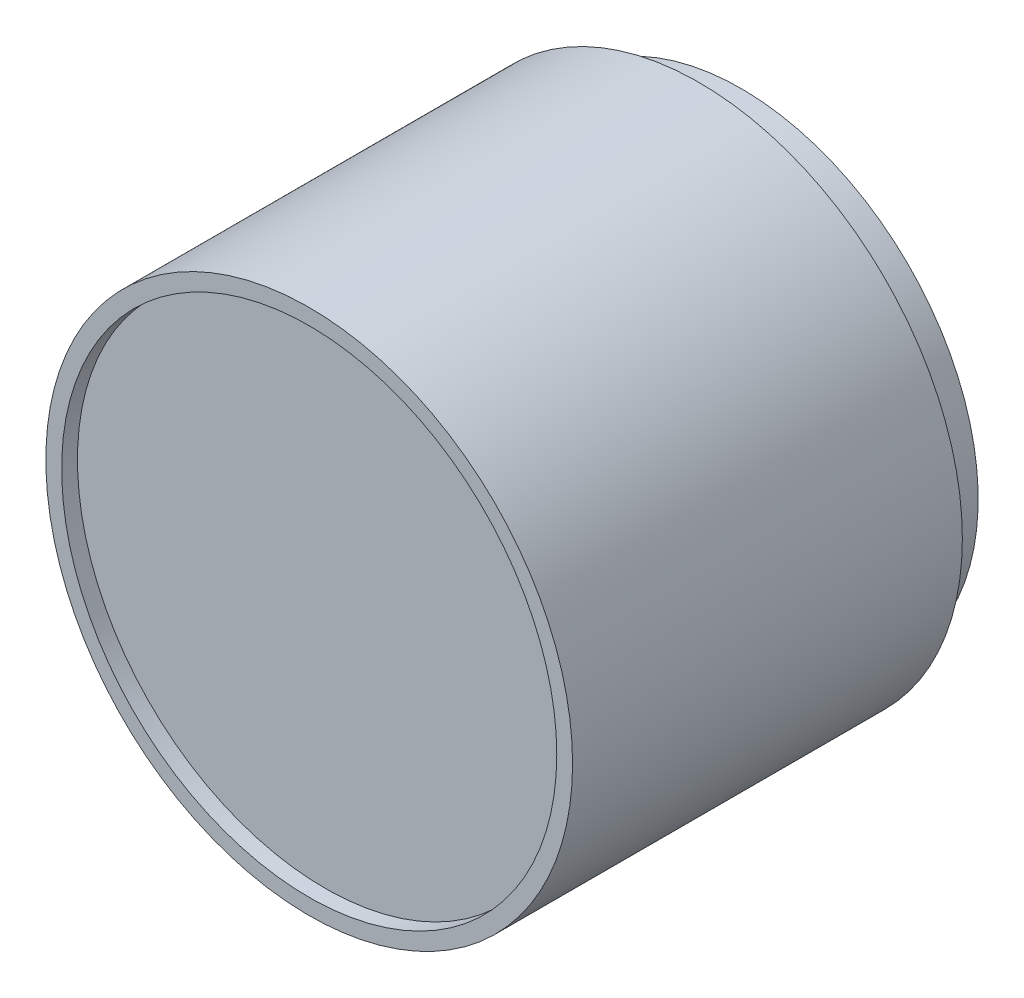
ISO-10303-21;
HEADER;
FILE_DESCRIPTION(('STEP AP214'),'2;1');
FILE_NAME('part.step','',(''),(''),'','','');
FILE_SCHEMA(('AUTOMOTIVE_DESIGN { 1 0 10303 214 1 1 1 1 }'));
ENDSEC;
DATA;
#1=APPLICATION_CONTEXT('core data for automotive mechanical design processes');
#2=APPLICATION_PROTOCOL_DEFINITION('international standard','automotive_design',2000,#1);
#3=PRODUCT_CONTEXT('',#1,'mechanical');
#4=PRODUCT('Part','Part','',(#3));
#5=PRODUCT_RELATED_PRODUCT_CATEGORY('part','',(#4));
#6=PRODUCT_DEFINITION_FORMATION('','',#4);
#7=PRODUCT_DEFINITION_CONTEXT('part definition',#1,'design');
#8=PRODUCT_DEFINITION('design','',#6,#7);
#9=PRODUCT_DEFINITION_SHAPE('','',#8);
#10=(LENGTH_UNIT() NAMED_UNIT(*) SI_UNIT(.MILLI.,.METRE.));
#11=(NAMED_UNIT(*) PLANE_ANGLE_UNIT() SI_UNIT($,.RADIAN.));
#12=(NAMED_UNIT(*) SI_UNIT($,.STERADIAN.) SOLID_ANGLE_UNIT());
#13=UNCERTAINTY_MEASURE_WITH_UNIT(LENGTH_MEASURE(1.E-05),#10,'distance_accuracy_value','');
#14=(GEOMETRIC_REPRESENTATION_CONTEXT(3) GLOBAL_UNCERTAINTY_ASSIGNED_CONTEXT((#13)) GLOBAL_UNIT_ASSIGNED_CONTEXT((#10,
#11,#12)) REPRESENTATION_CONTEXT('',''));
#15=CARTESIAN_POINT('',(0.,0.,0.));
#16=DIRECTION('',(0.,0.,1.));
#17=DIRECTION('',(1.,0.,0.));
#18=AXIS2_PLACEMENT_3D('',#15,#16,#17);
#19=CARTESIAN_POINT('',(0.,0.,8.4));
#20=DIRECTION('',(0.,0.,-1.));
#21=DIRECTION('',(-1.,0.,0.));
#22=AXIS2_PLACEMENT_3D('',#19,#20,#21);
#23=PLANE('',#22);
#24=CARTESIAN_POINT('',(0.,0.,8.4));
#25=DIRECTION('',(0.,0.,-1.));
#26=DIRECTION('',(-1.,0.,0.));
#27=AXIS2_PLACEMENT_3D('',#24,#25,#26);
#28=CIRCLE('',#27,45.);
#29=CARTESIAN_POINT('',(-45.,0.,8.4));
#30=VERTEX_POINT('',#29);
#31=EDGE_CURVE('E21',#30,#30,#28,.T.);
#32=ORIENTED_EDGE('',*,*,#31,.F.);
#33=EDGE_LOOP('',(#32));
#34=FACE_BOUND('',#33,.T.);
#35=CARTESIAN_POINT('',(0.,0.,8.4));
#36=DIRECTION('',(0.,0.,1.));
#37=DIRECTION('',(1.,0.,0.));
#38=AXIS2_PLACEMENT_3D('',#35,#36,#37);
#39=CIRCLE('',#38,50.);
#40=CARTESIAN_POINT('',(50.,0.,8.4));
#41=VERTEX_POINT('',#40);
#42=EDGE_CURVE('E10',#41,#41,#39,.T.);
#43=ORIENTED_EDGE('',*,*,#42,.F.);
#44=EDGE_LOOP('',(#43));
#45=FACE_BOUND('',#44,.T.);
#46=ADVANCED_FACE('F14',(#34,#45),#23,.T.);
#47=CARTESIAN_POINT('',(0.,0.,-17.36136204513));
#48=DIRECTION('',(0.,0.,1.));
#49=DIRECTION('',(1.,0.,0.));
#50=AXIS2_PLACEMENT_3D('',#47,#48,#49);
#51=CYLINDRICAL_SURFACE('',#50,50.);
#52=ORIENTED_EDGE('',*,*,#42,.T.);
#53=EDGE_LOOP('',(#52));
#54=FACE_BOUND('',#53,.T.);
#55=CARTESIAN_POINT('',(0.,0.,82.4));
#56=DIRECTION('',(0.,0.,1.));
#57=DIRECTION('',(1.,0.,0.));
#58=AXIS2_PLACEMENT_3D('',#55,#56,#57);
#59=CIRCLE('',#58,50.);
#60=CARTESIAN_POINT('',(50.,0.,82.4));
#61=VERTEX_POINT('',#60);
#62=EDGE_CURVE('E29',#61,#61,#59,.F.);
#63=ORIENTED_EDGE('',*,*,#62,.T.);
#64=EDGE_LOOP('',(#63));
#65=FACE_BOUND('',#64,.T.);
#66=ADVANCED_FACE('F59',(#54,#65),#51,.T.);
#67=CARTESIAN_POINT('',(0.,0.,92.1));
#68=DIRECTION('',(0.,0.,-1.));
#69=DIRECTION('',(-1.,0.,0.));
#70=AXIS2_PLACEMENT_3D('',#67,#68,#69);
#71=CYLINDRICAL_SURFACE('',#70,45.);
#72=ORIENTED_EDGE('',*,*,#31,.T.);
#73=EDGE_LOOP('',(#72));
#74=FACE_BOUND('',#73,.T.);
#75=CARTESIAN_POINT('',(0.,0.,0.4));
#76=DIRECTION('',(0.,0.,-1.));
#77=DIRECTION('',(-1.,0.,0.));
#78=AXIS2_PLACEMENT_3D('',#75,#76,#77);
#79=CIRCLE('',#78,45.);
#80=CARTESIAN_POINT('',(-45.,0.,0.4));
#81=VERTEX_POINT('',#80);
#82=EDGE_CURVE('E34',#81,#81,#79,.F.);
#83=ORIENTED_EDGE('',*,*,#82,.T.);
#84=EDGE_LOOP('',(#83));
#85=FACE_BOUND('',#84,.T.);
#86=ADVANCED_FACE('F56',(#74,#85),#71,.T.);
#87=CARTESIAN_POINT('',(0.,0.,82.4));
#88=DIRECTION('',(0.,0.,-1.));
#89=DIRECTION('',(-1.,0.,0.));
#90=AXIS2_PLACEMENT_3D('',#87,#88,#89);
#91=PLANE('',#90);
#92=CARTESIAN_POINT('',(0.,0.,82.4));
#93=DIRECTION('',(0.,0.,1.));
#94=DIRECTION('',(1.,0.,0.));
#95=AXIS2_PLACEMENT_3D('',#92,#93,#94);
#96=CIRCLE('',#95,47.);
#97=CARTESIAN_POINT('',(47.,0.,82.4));
#98=VERTEX_POINT('',#97);
#99=EDGE_CURVE('E25',#98,#98,#96,.T.);
#100=ORIENTED_EDGE('',*,*,#99,.F.);
#101=EDGE_LOOP('',(#100));
#102=FACE_BOUND('',#101,.T.);
#103=ORIENTED_EDGE('',*,*,#62,.F.);
#104=EDGE_LOOP('',(#103));
#105=FACE_BOUND('',#104,.T.);
#106=ADVANCED_FACE('F58',(#102,#105),#91,.F.);
#107=CARTESIAN_POINT('',(0.,0.,79.25));
#108=DIRECTION('',(0.,0.,1.));
#109=DIRECTION('',(1.,0.,0.));
#110=AXIS2_PLACEMENT_3D('',#107,#108,#109);
#111=CYLINDRICAL_SURFACE('',#110,47.);
#112=ORIENTED_EDGE('',*,*,#99,.T.);
#113=EDGE_LOOP('',(#112));
#114=FACE_BOUND('',#113,.T.);
#115=CARTESIAN_POINT('',(0.,0.,79.4));
#116=DIRECTION('',(0.,0.,1.));
#117=DIRECTION('',(1.,0.,0.));
#118=AXIS2_PLACEMENT_3D('',#115,#116,#117);
#119=CIRCLE('',#118,47.);
#120=CARTESIAN_POINT('',(47.,0.,79.4));
#121=VERTEX_POINT('',#120);
#122=EDGE_CURVE('E32',#121,#121,#119,.F.);
#123=ORIENTED_EDGE('',*,*,#122,.T.);
#124=EDGE_LOOP('',(#123));
#125=FACE_BOUND('',#124,.T.);
#126=ADVANCED_FACE('F52',(#114,#125),#111,.F.);
#127=CARTESIAN_POINT('',(0.,0.,0.4));
#128=DIRECTION('',(0.,0.,-1.));
#129=DIRECTION('',(-1.,0.,0.));
#130=AXIS2_PLACEMENT_3D('',#127,#128,#129);
#131=PLANE('',#130);
#132=CARTESIAN_POINT('',(0.,0.,0.4));
#133=DIRECTION('',(0.,0.,-1.));
#134=DIRECTION('',(-1.,0.,0.));
#135=AXIS2_PLACEMENT_3D('',#132,#133,#134);
#136=CIRCLE('',#135,36.7619057711847);
#137=CARTESIAN_POINT('',(-36.7619057711847,0.,0.4));
#138=VERTEX_POINT('',#137);
#139=EDGE_CURVE('E41',#138,#138,#136,.T.);
#140=ORIENTED_EDGE('',*,*,#139,.F.);
#141=EDGE_LOOP('',(#140));
#142=FACE_BOUND('',#141,.T.);
#143=ORIENTED_EDGE('',*,*,#82,.F.);
#144=EDGE_LOOP('',(#143));
#145=FACE_BOUND('',#144,.T.);
#146=ADVANCED_FACE('F49',(#142,#145),#131,.T.);
#147=CARTESIAN_POINT('',(0.,0.,0.882550251648887));
#148=DIRECTION('',(0.,0.,-1.));
#149=DIRECTION('',(-1.,0.,0.));
#150=AXIS2_PLACEMENT_3D('',#147,#148,#149);
#151=CONICAL_SURFACE('',#150,36.7450547450786,0.0349065850398802);
#152=CARTESIAN_POINT('',(0.,0.,7.9));
#153=DIRECTION('',(0.,0.,1.));
#154=DIRECTION('',(1.,0.,0.));
#155=AXIS2_PLACEMENT_3D('',#152,#153,#154);
#156=CIRCLE('',#155,36.4999999999966);
#157=CARTESIAN_POINT('',(36.4999999999966,0.,7.9));
#158=VERTEX_POINT('',#157);
#159=EDGE_CURVE('E38',#158,#158,#156,.F.);
#160=ORIENTED_EDGE('',*,*,#159,.F.);
#161=EDGE_LOOP('',(#160));
#162=FACE_BOUND('',#161,.T.);
#163=ORIENTED_EDGE('',*,*,#139,.T.);
#164=EDGE_LOOP('',(#163));
#165=FACE_BOUND('',#164,.T.);
#166=ADVANCED_FACE('F47',(#162,#165),#151,.F.);
#167=CARTESIAN_POINT('',(0.,0.,7.9));
#168=DIRECTION('',(0.,0.,-1.));
#169=DIRECTION('',(-1.,0.,0.));
#170=AXIS2_PLACEMENT_3D('',#167,#168,#169);
#171=PLANE('',#170);
#172=ORIENTED_EDGE('',*,*,#159,.T.);
#173=EDGE_LOOP('',(#172));
#174=FACE_BOUND('',#173,.T.);
#175=ADVANCED_FACE('F16',(#174),#171,.T.);
#176=CARTESIAN_POINT('',(0.,0.,79.4));
#177=DIRECTION('',(0.,0.,1.));
#178=DIRECTION('',(1.,0.,0.));
#179=AXIS2_PLACEMENT_3D('',#176,#177,#178);
#180=PLANE('',#179);
#181=ORIENTED_EDGE('',*,*,#122,.F.);
#182=EDGE_LOOP('',(#181));
#183=FACE_BOUND('',#182,.T.);
#184=ADVANCED_FACE('F70',(#183),#180,.T.);
#185=CLOSED_SHELL('',(#46,#66,#86,#106,#126,#146,#166,#175,#184));
#186=MANIFOLD_SOLID_BREP('B1',#185);
#187=ADVANCED_BREP_SHAPE_REPRESENTATION('',(#18,#186),#14);
#188=SHAPE_DEFINITION_REPRESENTATION(#9,#187);
ENDSEC;
END-ISO-10303-21;
